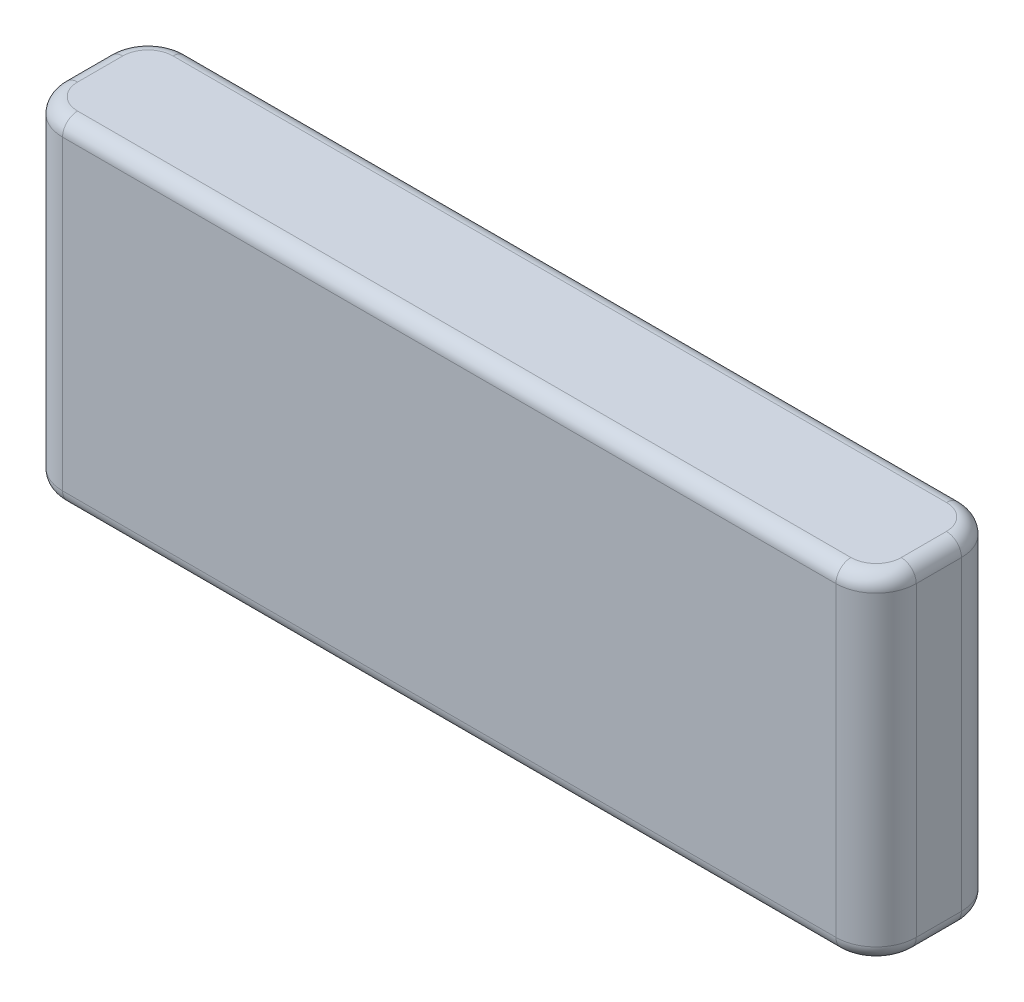
ISO-10303-21;
HEADER;
FILE_DESCRIPTION(('STEP AP214'),'2;1');
FILE_NAME('part.step','',(''),(''),'','','');
FILE_SCHEMA(('AUTOMOTIVE_DESIGN { 1 0 10303 214 1 1 1 1 }'));
ENDSEC;
DATA;
#1=APPLICATION_CONTEXT('core data for automotive mechanical design processes');
#2=APPLICATION_PROTOCOL_DEFINITION('international standard','automotive_design',2000,#1);
#3=PRODUCT_CONTEXT('',#1,'mechanical');
#4=PRODUCT('Part','Part','',(#3));
#5=PRODUCT_RELATED_PRODUCT_CATEGORY('part','',(#4));
#6=PRODUCT_DEFINITION_FORMATION('','',#4);
#7=PRODUCT_DEFINITION_CONTEXT('part definition',#1,'design');
#8=PRODUCT_DEFINITION('design','',#6,#7);
#9=PRODUCT_DEFINITION_SHAPE('','',#8);
#10=(LENGTH_UNIT() NAMED_UNIT(*) SI_UNIT(.MILLI.,.METRE.));
#11=(NAMED_UNIT(*) PLANE_ANGLE_UNIT() SI_UNIT($,.RADIAN.));
#12=(NAMED_UNIT(*) SI_UNIT($,.STERADIAN.) SOLID_ANGLE_UNIT());
#13=UNCERTAINTY_MEASURE_WITH_UNIT(LENGTH_MEASURE(1.E-05),#10,'distance_accuracy_value','');
#14=(GEOMETRIC_REPRESENTATION_CONTEXT(3) GLOBAL_UNCERTAINTY_ASSIGNED_CONTEXT((#13)) GLOBAL_UNIT_ASSIGNED_CONTEXT((#10,
#11,#12)) REPRESENTATION_CONTEXT('',''));
#15=CARTESIAN_POINT('',(0.,0.,0.));
#16=DIRECTION('',(0.,0.,1.));
#17=DIRECTION('',(1.,0.,0.));
#18=AXIS2_PLACEMENT_3D('',#15,#16,#17);
#19=CARTESIAN_POINT('',(-85.,33.5,12.5));
#20=DIRECTION('',(1.,0.,0.));
#21=DIRECTION('',(0.,0.,-1.));
#22=AXIS2_PLACEMENT_3D('',#19,#20,#21);
#23=PLANE('',#22);
#24=DIRECTION('',(0.,-1.,0.));
#25=VECTOR('',#24,1.);
#26=CARTESIAN_POINT('',(-85.,33.5,-4.50000000000001));
#27=LINE('',#26,#25);
#28=CARTESIAN_POINT('',(-85.,30.5,-4.50000000000001));
#29=VERTEX_POINT('',#28);
#30=CARTESIAN_POINT('',(-85.,-30.5,-4.50000000000001));
#31=VERTEX_POINT('',#30);
#32=EDGE_CURVE('E284',#29,#31,#27,.T.);
#33=ORIENTED_EDGE('',*,*,#32,.T.);
#34=DIRECTION('',(0.,0.,1.));
#35=VECTOR('',#34,1.);
#36=CARTESIAN_POINT('',(-85.,-30.5,4.5));
#37=LINE('',#36,#35);
#38=CARTESIAN_POINT('',(-85.,-30.5,4.5));
#39=VERTEX_POINT('',#38);
#40=EDGE_CURVE('E200',#31,#39,#37,.T.);
#41=ORIENTED_EDGE('',*,*,#40,.T.);
#42=DIRECTION('',(0.,-1.,0.));
#43=VECTOR('',#42,1.);
#44=CARTESIAN_POINT('',(-85.,33.5,4.5));
#45=LINE('',#44,#43);
#46=CARTESIAN_POINT('',(-85.,30.5,4.5));
#47=VERTEX_POINT('',#46);
#48=EDGE_CURVE('E289',#39,#47,#45,.F.);
#49=ORIENTED_EDGE('',*,*,#48,.T.);
#50=DIRECTION('',(0.,0.,1.));
#51=VECTOR('',#50,1.);
#52=CARTESIAN_POINT('',(-85.,30.5,12.5));
#53=LINE('',#52,#51);
#54=EDGE_CURVE('E198',#47,#29,#53,.F.);
#55=ORIENTED_EDGE('',*,*,#54,.T.);
#56=EDGE_LOOP('',(#33,#41,#49,#55));
#57=FACE_BOUND('',#56,.T.);
#58=ADVANCED_FACE('F34',(#57),#23,.F.);
#59=CARTESIAN_POINT('',(-85.,33.5,12.5));
#60=DIRECTION('',(0.,0.,-1.));
#61=DIRECTION('',(-1.,0.,0.));
#62=AXIS2_PLACEMENT_3D('',#59,#60,#61);
#63=PLANE('',#62);
#64=DIRECTION('',(0.,-1.,0.));
#65=VECTOR('',#64,1.);
#66=CARTESIAN_POINT('',(-77.,33.5,12.5));
#67=LINE('',#66,#65);
#68=CARTESIAN_POINT('',(-77.,30.5,12.5));
#69=VERTEX_POINT('',#68);
#70=CARTESIAN_POINT('',(-77.,-30.5,12.5));
#71=VERTEX_POINT('',#70);
#72=EDGE_CURVE('E282',#69,#71,#67,.T.);
#73=ORIENTED_EDGE('',*,*,#72,.T.);
#74=DIRECTION('',(1.,0.,0.));
#75=VECTOR('',#74,1.);
#76=CARTESIAN_POINT('',(77.,-30.5,12.5));
#77=LINE('',#76,#75);
#78=CARTESIAN_POINT('',(77.,-30.5,12.5));
#79=VERTEX_POINT('',#78);
#80=EDGE_CURVE('E208',#71,#79,#77,.T.);
#81=ORIENTED_EDGE('',*,*,#80,.T.);
#82=DIRECTION('',(0.,-1.,0.));
#83=VECTOR('',#82,1.);
#84=CARTESIAN_POINT('',(77.,33.5,12.5));
#85=LINE('',#84,#83);
#86=CARTESIAN_POINT('',(77.,30.5,12.5));
#87=VERTEX_POINT('',#86);
#88=EDGE_CURVE('E239',#79,#87,#85,.F.);
#89=ORIENTED_EDGE('',*,*,#88,.T.);
#90=DIRECTION('',(1.,0.,0.));
#91=VECTOR('',#90,1.);
#92=CARTESIAN_POINT('',(-85.,30.5,12.5));
#93=LINE('',#92,#91);
#94=EDGE_CURVE('E206',#87,#69,#93,.F.);
#95=ORIENTED_EDGE('',*,*,#94,.T.);
#96=EDGE_LOOP('',(#73,#81,#89,#95));
#97=FACE_BOUND('',#96,.T.);
#98=ADVANCED_FACE('F280',(#97),#63,.F.);
#99=CARTESIAN_POINT('',(85.,33.5,12.5));
#100=DIRECTION('',(-1.,0.,0.));
#101=DIRECTION('',(0.,0.,1.));
#102=AXIS2_PLACEMENT_3D('',#99,#100,#101);
#103=PLANE('',#102);
#104=DIRECTION('',(0.,-1.,0.));
#105=VECTOR('',#104,1.);
#106=CARTESIAN_POINT('',(85.,33.5,4.5));
#107=LINE('',#106,#105);
#108=CARTESIAN_POINT('',(85.,30.5,4.5));
#109=VERTEX_POINT('',#108);
#110=CARTESIAN_POINT('',(85.,-30.5,4.5));
#111=VERTEX_POINT('',#110);
#112=EDGE_CURVE('E277',#109,#111,#107,.T.);
#113=ORIENTED_EDGE('',*,*,#112,.T.);
#114=DIRECTION('',(0.,0.,-1.));
#115=VECTOR('',#114,1.);
#116=CARTESIAN_POINT('',(85.,-30.5,-4.50000000000001));
#117=LINE('',#116,#115);
#118=CARTESIAN_POINT('',(85.,-30.5,-4.50000000000001));
#119=VERTEX_POINT('',#118);
#120=EDGE_CURVE('E183',#111,#119,#117,.T.);
#121=ORIENTED_EDGE('',*,*,#120,.T.);
#122=DIRECTION('',(0.,-1.,0.));
#123=VECTOR('',#122,1.);
#124=CARTESIAN_POINT('',(85.,33.5,-4.50000000000001));
#125=LINE('',#124,#123);
#126=CARTESIAN_POINT('',(85.,30.5,-4.50000000000001));
#127=VERTEX_POINT('',#126);
#128=EDGE_CURVE('E167',#119,#127,#125,.F.);
#129=ORIENTED_EDGE('',*,*,#128,.T.);
#130=DIRECTION('',(0.,0.,-1.));
#131=VECTOR('',#130,1.);
#132=CARTESIAN_POINT('',(85.,30.5,12.5));
#133=LINE('',#132,#131);
#134=EDGE_CURVE('E181',#127,#109,#133,.F.);
#135=ORIENTED_EDGE('',*,*,#134,.T.);
#136=EDGE_LOOP('',(#113,#121,#129,#135));
#137=FACE_BOUND('',#136,.T.);
#138=ADVANCED_FACE('F319',(#137),#103,.F.);
#139=CARTESIAN_POINT('',(-85.,33.5,-12.5));
#140=DIRECTION('',(0.,0.,1.));
#141=DIRECTION('',(1.,0.,0.));
#142=AXIS2_PLACEMENT_3D('',#139,#140,#141);
#143=PLANE('',#142);
#144=DIRECTION('',(0.,-1.,0.));
#145=VECTOR('',#144,1.);
#146=CARTESIAN_POINT('',(77.,33.5,-12.5));
#147=LINE('',#146,#145);
#148=CARTESIAN_POINT('',(77.,30.5,-12.5));
#149=VERTEX_POINT('',#148);
#150=CARTESIAN_POINT('',(77.,-30.5,-12.5));
#151=VERTEX_POINT('',#150);
#152=EDGE_CURVE('E292',#149,#151,#147,.T.);
#153=ORIENTED_EDGE('',*,*,#152,.T.);
#154=DIRECTION('',(-1.,0.,0.));
#155=VECTOR('',#154,1.);
#156=CARTESIAN_POINT('',(-77.,-30.5,-12.5));
#157=LINE('',#156,#155);
#158=CARTESIAN_POINT('',(-77.,-30.5,-12.5));
#159=VERTEX_POINT('',#158);
#160=EDGE_CURVE('E191',#151,#159,#157,.T.);
#161=ORIENTED_EDGE('',*,*,#160,.T.);
#162=DIRECTION('',(0.,-1.,0.));
#163=VECTOR('',#162,1.);
#164=CARTESIAN_POINT('',(-77.,33.5,-12.5));
#165=LINE('',#164,#163);
#166=CARTESIAN_POINT('',(-77.,30.5,-12.5));
#167=VERTEX_POINT('',#166);
#168=EDGE_CURVE('E295',#159,#167,#165,.F.);
#169=ORIENTED_EDGE('',*,*,#168,.T.);
#170=DIRECTION('',(-1.,0.,0.));
#171=VECTOR('',#170,1.);
#172=CARTESIAN_POINT('',(-85.,30.5,-12.5));
#173=LINE('',#172,#171);
#174=EDGE_CURVE('E189',#167,#149,#173,.F.);
#175=ORIENTED_EDGE('',*,*,#174,.T.);
#176=EDGE_LOOP('',(#153,#161,#169,#175));
#177=FACE_BOUND('',#176,.T.);
#178=ADVANCED_FACE('F362',(#177),#143,.F.);
#179=CARTESIAN_POINT('',(0.,33.5,0.));
#180=DIRECTION('',(0.,-1.,0.));
#181=DIRECTION('',(0.,0.,-1.));
#182=AXIS2_PLACEMENT_3D('',#179,#180,#181);
#183=PLANE('',#182);
#184=DIRECTION('',(-1.,0.,0.));
#185=VECTOR('',#184,1.);
#186=CARTESIAN_POINT('',(0.,33.5,-9.50000000000001));
#187=LINE('',#186,#185);
#188=CARTESIAN_POINT('',(77.,33.5,-9.50000000000001));
#189=VERTEX_POINT('',#188);
#190=CARTESIAN_POINT('',(-77.,33.5,-9.50000000000001));
#191=VERTEX_POINT('',#190);
#192=EDGE_CURVE('E43',#189,#191,#187,.T.);
#193=ORIENTED_EDGE('',*,*,#192,.T.);
#194=CARTESIAN_POINT('',(-77.,33.5,-4.50000000000001));
#195=DIRECTION('',(0.,-1.,0.));
#196=DIRECTION('',(0.,0.,-1.));
#197=AXIS2_PLACEMENT_3D('',#194,#195,#196);
#198=CIRCLE('',#197,5.);
#199=CARTESIAN_POINT('',(-82.,33.5,-4.50000000000001));
#200=VERTEX_POINT('',#199);
#201=EDGE_CURVE('E11',#191,#200,#198,.F.);
#202=ORIENTED_EDGE('',*,*,#201,.T.);
#203=DIRECTION('',(0.,0.,1.));
#204=VECTOR('',#203,1.);
#205=CARTESIAN_POINT('',(-82.,33.5,0.));
#206=LINE('',#205,#204);
#207=CARTESIAN_POINT('',(-82.,33.5,4.5));
#208=VERTEX_POINT('',#207);
#209=EDGE_CURVE('E210',#200,#208,#206,.T.);
#210=ORIENTED_EDGE('',*,*,#209,.T.);
#211=CARTESIAN_POINT('',(-77.,33.5,4.5));
#212=DIRECTION('',(0.,-1.,0.));
#213=DIRECTION('',(0.,0.,-1.));
#214=AXIS2_PLACEMENT_3D('',#211,#212,#213);
#215=CIRCLE('',#214,5.);
#216=CARTESIAN_POINT('',(-77.,33.5,9.49999999999999));
#217=VERTEX_POINT('',#216);
#218=EDGE_CURVE('E212',#208,#217,#215,.F.);
#219=ORIENTED_EDGE('',*,*,#218,.T.);
#220=DIRECTION('',(1.,0.,0.));
#221=VECTOR('',#220,1.);
#222=CARTESIAN_POINT('',(0.,33.5,9.49999999999999));
#223=LINE('',#222,#221);
#224=CARTESIAN_POINT('',(77.,33.5,9.49999999999999));
#225=VERTEX_POINT('',#224);
#226=EDGE_CURVE('E214',#217,#225,#223,.T.);
#227=ORIENTED_EDGE('',*,*,#226,.T.);
#228=CARTESIAN_POINT('',(77.,33.5,4.5));
#229=DIRECTION('',(0.,-1.,0.));
#230=DIRECTION('',(0.,0.,-1.));
#231=AXIS2_PLACEMENT_3D('',#228,#229,#230);
#232=CIRCLE('',#231,5.);
#233=CARTESIAN_POINT('',(82.,33.5,4.5));
#234=VERTEX_POINT('',#233);
#235=EDGE_CURVE('E216',#225,#234,#232,.F.);
#236=ORIENTED_EDGE('',*,*,#235,.T.);
#237=DIRECTION('',(0.,0.,-1.));
#238=VECTOR('',#237,1.);
#239=CARTESIAN_POINT('',(82.,33.5,0.));
#240=LINE('',#239,#238);
#241=CARTESIAN_POINT('',(82.,33.5,-4.50000000000001));
#242=VERTEX_POINT('',#241);
#243=EDGE_CURVE('E218',#234,#242,#240,.T.);
#244=ORIENTED_EDGE('',*,*,#243,.T.);
#245=CARTESIAN_POINT('',(77.,33.5,-4.50000000000001));
#246=DIRECTION('',(0.,-1.,0.));
#247=DIRECTION('',(0.,0.,-1.));
#248=AXIS2_PLACEMENT_3D('',#245,#246,#247);
#249=CIRCLE('',#248,5.);
#250=EDGE_CURVE('E54',#242,#189,#249,.F.);
#251=ORIENTED_EDGE('',*,*,#250,.T.);
#252=EDGE_LOOP('',(#193,#202,#210,#219,#227,#236,#244,#251));
#253=FACE_BOUND('',#252,.T.);
#254=ADVANCED_FACE('F335',(#253),#183,.F.);
#255=CARTESIAN_POINT('',(0.,-33.5,0.));
#256=DIRECTION('',(0.,-1.,0.));
#257=DIRECTION('',(0.,0.,-1.));
#258=AXIS2_PLACEMENT_3D('',#255,#256,#257);
#259=PLANE('',#258);
#260=DIRECTION('',(0.,0.,-1.));
#261=VECTOR('',#260,1.);
#262=CARTESIAN_POINT('',(82.,-33.5,4.5));
#263=LINE('',#262,#261);
#264=CARTESIAN_POINT('',(82.,-33.5,-4.50000000000001));
#265=VERTEX_POINT('',#264);
#266=CARTESIAN_POINT('',(82.,-33.5,4.5));
#267=VERTEX_POINT('',#266);
#268=EDGE_CURVE('E171',#265,#267,#263,.F.);
#269=ORIENTED_EDGE('',*,*,#268,.T.);
#270=CARTESIAN_POINT('',(77.,-33.5,4.5));
#271=DIRECTION('',(0.,-1.,0.));
#272=DIRECTION('',(0.,0.,-1.));
#273=AXIS2_PLACEMENT_3D('',#270,#271,#272);
#274=CIRCLE('',#273,5.);
#275=CARTESIAN_POINT('',(77.,-33.5,9.49999999999999));
#276=VERTEX_POINT('',#275);
#277=EDGE_CURVE('E152',#267,#276,#274,.T.);
#278=ORIENTED_EDGE('',*,*,#277,.T.);
#279=DIRECTION('',(1.,0.,0.));
#280=VECTOR('',#279,1.);
#281=CARTESIAN_POINT('',(-77.,-33.5,9.49999999999999));
#282=LINE('',#281,#280);
#283=CARTESIAN_POINT('',(-77.,-33.5,9.49999999999999));
#284=VERTEX_POINT('',#283);
#285=EDGE_CURVE('E160',#276,#284,#282,.F.);
#286=ORIENTED_EDGE('',*,*,#285,.T.);
#287=CARTESIAN_POINT('',(-77.,-33.5,4.5));
#288=DIRECTION('',(0.,-1.,0.));
#289=DIRECTION('',(0.,0.,-1.));
#290=AXIS2_PLACEMENT_3D('',#287,#288,#289);
#291=CIRCLE('',#290,5.);
#292=CARTESIAN_POINT('',(-82.,-33.5,4.5));
#293=VERTEX_POINT('',#292);
#294=EDGE_CURVE('E166',#284,#293,#291,.T.);
#295=ORIENTED_EDGE('',*,*,#294,.T.);
#296=DIRECTION('',(0.,0.,1.));
#297=VECTOR('',#296,1.);
#298=CARTESIAN_POINT('',(-82.,-33.5,-4.50000000000001));
#299=LINE('',#298,#297);
#300=CARTESIAN_POINT('',(-82.,-33.5,-4.50000000000001));
#301=VERTEX_POINT('',#300);
#302=EDGE_CURVE('E302',#293,#301,#299,.F.);
#303=ORIENTED_EDGE('',*,*,#302,.T.);
#304=CARTESIAN_POINT('',(-77.,-33.5,-4.50000000000001));
#305=DIRECTION('',(0.,-1.,0.));
#306=DIRECTION('',(0.,0.,-1.));
#307=AXIS2_PLACEMENT_3D('',#304,#305,#306);
#308=CIRCLE('',#307,5.);
#309=CARTESIAN_POINT('',(-77.,-33.5,-9.50000000000001));
#310=VERTEX_POINT('',#309);
#311=EDGE_CURVE('E304',#301,#310,#308,.T.);
#312=ORIENTED_EDGE('',*,*,#311,.T.);
#313=DIRECTION('',(-1.,0.,0.));
#314=VECTOR('',#313,1.);
#315=CARTESIAN_POINT('',(77.,-33.5,-9.50000000000001));
#316=LINE('',#315,#314);
#317=CARTESIAN_POINT('',(77.,-33.5,-9.50000000000001));
#318=VERTEX_POINT('',#317);
#319=EDGE_CURVE('E306',#310,#318,#316,.F.);
#320=ORIENTED_EDGE('',*,*,#319,.T.);
#321=CARTESIAN_POINT('',(77.,-33.5,-4.50000000000001));
#322=DIRECTION('',(0.,-1.,0.));
#323=DIRECTION('',(0.,0.,-1.));
#324=AXIS2_PLACEMENT_3D('',#321,#322,#323);
#325=CIRCLE('',#324,5.);
#326=EDGE_CURVE('E176',#318,#265,#325,.T.);
#327=ORIENTED_EDGE('',*,*,#326,.T.);
#328=EDGE_LOOP('',(#269,#278,#286,#295,#303,#312,#320,#327));
#329=FACE_BOUND('',#328,.T.);
#330=ADVANCED_FACE('F169',(#329),#259,.T.);
#331=CARTESIAN_POINT('',(-77.,33.5,4.5));
#332=DIRECTION('',(0.,-1.,0.));
#333=DIRECTION('',(0.,0.,-1.));
#334=AXIS2_PLACEMENT_3D('',#331,#332,#333);
#335=CYLINDRICAL_SURFACE('',#334,8.);
#336=ORIENTED_EDGE('',*,*,#48,.F.);
#337=CARTESIAN_POINT('',(-77.,-30.5,4.5));
#338=DIRECTION('',(0.,-1.,0.));
#339=DIRECTION('',(0.,0.,-1.));
#340=AXIS2_PLACEMENT_3D('',#337,#338,#339);
#341=CIRCLE('',#340,8.);
#342=EDGE_CURVE('E204',#39,#71,#341,.F.);
#343=ORIENTED_EDGE('',*,*,#342,.T.);
#344=ORIENTED_EDGE('',*,*,#72,.F.);
#345=CARTESIAN_POINT('',(-77.,30.5,4.5));
#346=DIRECTION('',(0.,-1.,0.));
#347=DIRECTION('',(0.,0.,-1.));
#348=AXIS2_PLACEMENT_3D('',#345,#346,#347);
#349=CIRCLE('',#348,8.);
#350=EDGE_CURVE('E202',#69,#47,#349,.T.);
#351=ORIENTED_EDGE('',*,*,#350,.T.);
#352=EDGE_LOOP('',(#336,#343,#344,#351));
#353=FACE_BOUND('',#352,.T.);
#354=ADVANCED_FACE('F379',(#353),#335,.T.);
#355=CARTESIAN_POINT('',(-77.,33.5,-4.50000000000001));
#356=DIRECTION('',(0.,-1.,0.));
#357=DIRECTION('',(0.,0.,-1.));
#358=AXIS2_PLACEMENT_3D('',#355,#356,#357);
#359=CYLINDRICAL_SURFACE('',#358,8.);
#360=ORIENTED_EDGE('',*,*,#168,.F.);
#361=CARTESIAN_POINT('',(-77.,-30.5,-4.50000000000001));
#362=DIRECTION('',(0.,-1.,0.));
#363=DIRECTION('',(0.,0.,-1.));
#364=AXIS2_PLACEMENT_3D('',#361,#362,#363);
#365=CIRCLE('',#364,8.);
#366=EDGE_CURVE('E196',#159,#31,#365,.F.);
#367=ORIENTED_EDGE('',*,*,#366,.T.);
#368=ORIENTED_EDGE('',*,*,#32,.F.);
#369=CARTESIAN_POINT('',(-77.,30.5,-4.50000000000001));
#370=DIRECTION('',(0.,-1.,0.));
#371=DIRECTION('',(0.,0.,-1.));
#372=AXIS2_PLACEMENT_3D('',#369,#370,#371);
#373=CIRCLE('',#372,8.);
#374=EDGE_CURVE('E193',#29,#167,#373,.T.);
#375=ORIENTED_EDGE('',*,*,#374,.T.);
#376=EDGE_LOOP('',(#360,#367,#368,#375));
#377=FACE_BOUND('',#376,.T.);
#378=ADVANCED_FACE('F351',(#377),#359,.T.);
#379=CARTESIAN_POINT('',(77.,33.5,-4.50000000000001));
#380=DIRECTION('',(0.,-1.,0.));
#381=DIRECTION('',(0.,0.,-1.));
#382=AXIS2_PLACEMENT_3D('',#379,#380,#381);
#383=CYLINDRICAL_SURFACE('',#382,8.);
#384=ORIENTED_EDGE('',*,*,#128,.F.);
#385=CARTESIAN_POINT('',(77.,-30.5,-4.50000000000001));
#386=DIRECTION('',(0.,-1.,0.));
#387=DIRECTION('',(0.,0.,-1.));
#388=AXIS2_PLACEMENT_3D('',#385,#386,#387);
#389=CIRCLE('',#388,8.);
#390=EDGE_CURVE('E187',#119,#151,#389,.F.);
#391=ORIENTED_EDGE('',*,*,#390,.T.);
#392=ORIENTED_EDGE('',*,*,#152,.F.);
#393=CARTESIAN_POINT('',(77.,30.5,-4.50000000000001));
#394=DIRECTION('',(0.,-1.,0.));
#395=DIRECTION('',(0.,0.,-1.));
#396=AXIS2_PLACEMENT_3D('',#393,#394,#395);
#397=CIRCLE('',#396,8.);
#398=EDGE_CURVE('E185',#149,#127,#397,.T.);
#399=ORIENTED_EDGE('',*,*,#398,.T.);
#400=EDGE_LOOP('',(#384,#391,#392,#399));
#401=FACE_BOUND('',#400,.T.);
#402=ADVANCED_FACE('F321',(#401),#383,.T.);
#403=CARTESIAN_POINT('',(77.,33.5,4.5));
#404=DIRECTION('',(0.,-1.,0.));
#405=DIRECTION('',(0.,0.,-1.));
#406=AXIS2_PLACEMENT_3D('',#403,#404,#405);
#407=CYLINDRICAL_SURFACE('',#406,8.);
#408=ORIENTED_EDGE('',*,*,#88,.F.);
#409=CARTESIAN_POINT('',(77.,-30.5,4.5));
#410=DIRECTION('',(0.,-1.,0.));
#411=DIRECTION('',(0.,0.,-1.));
#412=AXIS2_PLACEMENT_3D('',#409,#410,#411);
#413=CIRCLE('',#412,8.);
#414=EDGE_CURVE('E154',#79,#111,#413,.F.);
#415=ORIENTED_EDGE('',*,*,#414,.T.);
#416=ORIENTED_EDGE('',*,*,#112,.F.);
#417=CARTESIAN_POINT('',(77.,30.5,4.5));
#418=DIRECTION('',(0.,-1.,0.));
#419=DIRECTION('',(0.,0.,-1.));
#420=AXIS2_PLACEMENT_3D('',#417,#418,#419);
#421=CIRCLE('',#420,8.);
#422=EDGE_CURVE('E173',#109,#87,#421,.T.);
#423=ORIENTED_EDGE('',*,*,#422,.T.);
#424=EDGE_LOOP('',(#408,#415,#416,#423));
#425=FACE_BOUND('',#424,.T.);
#426=ADVANCED_FACE('F275',(#425),#407,.T.);
#427=CARTESIAN_POINT('',(-77.,-30.5,-4.50000000000001));
#428=DIRECTION('',(0.,-1.,0.));
#429=DIRECTION('',(0.,0.,-1.));
#430=AXIS2_PLACEMENT_3D('',#427,#428,#429);
#431=TOROIDAL_SURFACE('',#430,5.,3.);
#432=CARTESIAN_POINT('',(-82.,-30.5,-4.50000000000001));
#433=DIRECTION('',(0.,0.,1.));
#434=DIRECTION('',(1.,0.,0.));
#435=AXIS2_PLACEMENT_3D('',#432,#433,#434);
#436=CIRCLE('',#435,3.);
#437=EDGE_CURVE('E233',#31,#301,#436,.T.);
#438=ORIENTED_EDGE('',*,*,#437,.F.);
#439=ORIENTED_EDGE('',*,*,#366,.F.);
#440=CARTESIAN_POINT('',(-77.,-30.5,-9.50000000000001));
#441=DIRECTION('',(1.,0.,0.));
#442=DIRECTION('',(0.,0.,-1.));
#443=AXIS2_PLACEMENT_3D('',#440,#441,#442);
#444=CIRCLE('',#443,3.);
#445=EDGE_CURVE('E236',#310,#159,#444,.T.);
#446=ORIENTED_EDGE('',*,*,#445,.F.);
#447=ORIENTED_EDGE('',*,*,#311,.F.);
#448=EDGE_LOOP('',(#438,#439,#446,#447));
#449=FACE_BOUND('',#448,.T.);
#450=ADVANCED_FACE('F355',(#449),#431,.T.);
#451=CARTESIAN_POINT('',(-85.,-30.5,-9.50000000000001));
#452=DIRECTION('',(1.,0.,0.));
#453=DIRECTION('',(0.,0.,-1.));
#454=AXIS2_PLACEMENT_3D('',#451,#452,#453);
#455=CYLINDRICAL_SURFACE('',#454,3.);
#456=ORIENTED_EDGE('',*,*,#445,.T.);
#457=ORIENTED_EDGE('',*,*,#160,.F.);
#458=CARTESIAN_POINT('',(77.,-30.5,-9.50000000000001));
#459=DIRECTION('',(1.,0.,0.));
#460=DIRECTION('',(0.,0.,-1.));
#461=AXIS2_PLACEMENT_3D('',#458,#459,#460);
#462=CIRCLE('',#461,3.);
#463=EDGE_CURVE('E230',#318,#151,#462,.T.);
#464=ORIENTED_EDGE('',*,*,#463,.F.);
#465=ORIENTED_EDGE('',*,*,#319,.F.);
#466=EDGE_LOOP('',(#456,#457,#464,#465));
#467=FACE_BOUND('',#466,.T.);
#468=ADVANCED_FACE('F360',(#467),#455,.T.);
#469=CARTESIAN_POINT('',(-82.,-30.5,12.5));
#470=DIRECTION('',(0.,0.,-1.));
#471=DIRECTION('',(-1.,0.,0.));
#472=AXIS2_PLACEMENT_3D('',#469,#470,#471);
#473=CYLINDRICAL_SURFACE('',#472,3.);
#474=ORIENTED_EDGE('',*,*,#437,.T.);
#475=ORIENTED_EDGE('',*,*,#302,.F.);
#476=CARTESIAN_POINT('',(-82.,-30.5,4.5));
#477=DIRECTION('',(0.,0.,1.));
#478=DIRECTION('',(1.,0.,0.));
#479=AXIS2_PLACEMENT_3D('',#476,#477,#478);
#480=CIRCLE('',#479,3.);
#481=EDGE_CURVE('E227',#39,#293,#480,.T.);
#482=ORIENTED_EDGE('',*,*,#481,.F.);
#483=ORIENTED_EDGE('',*,*,#40,.F.);
#484=EDGE_LOOP('',(#474,#475,#482,#483));
#485=FACE_BOUND('',#484,.T.);
#486=ADVANCED_FACE('F401',(#485),#473,.T.);
#487=CARTESIAN_POINT('',(77.,-30.5,-4.50000000000001));
#488=DIRECTION('',(0.,-1.,0.));
#489=DIRECTION('',(0.,0.,-1.));
#490=AXIS2_PLACEMENT_3D('',#487,#488,#489);
#491=TOROIDAL_SURFACE('',#490,5.,3.);
#492=ORIENTED_EDGE('',*,*,#463,.T.);
#493=ORIENTED_EDGE('',*,*,#390,.F.);
#494=CARTESIAN_POINT('',(82.,-30.5,-4.50000000000001));
#495=DIRECTION('',(0.,0.,1.));
#496=DIRECTION('',(1.,0.,0.));
#497=AXIS2_PLACEMENT_3D('',#494,#495,#496);
#498=CIRCLE('',#497,3.);
#499=EDGE_CURVE('E224',#265,#119,#498,.T.);
#500=ORIENTED_EDGE('',*,*,#499,.F.);
#501=ORIENTED_EDGE('',*,*,#326,.F.);
#502=EDGE_LOOP('',(#492,#493,#500,#501));
#503=FACE_BOUND('',#502,.T.);
#504=ADVANCED_FACE('F313',(#503),#491,.T.);
#505=CARTESIAN_POINT('',(-77.,-30.5,4.5));
#506=DIRECTION('',(0.,-1.,0.));
#507=DIRECTION('',(0.,0.,-1.));
#508=AXIS2_PLACEMENT_3D('',#505,#506,#507);
#509=TOROIDAL_SURFACE('',#508,5.,3.);
#510=ORIENTED_EDGE('',*,*,#481,.T.);
#511=ORIENTED_EDGE('',*,*,#294,.F.);
#512=CARTESIAN_POINT('',(-77.,-30.5,9.49999999999999));
#513=DIRECTION('',(1.,0.,0.));
#514=DIRECTION('',(0.,0.,-1.));
#515=AXIS2_PLACEMENT_3D('',#512,#513,#514);
#516=CIRCLE('',#515,3.);
#517=EDGE_CURVE('E163',#71,#284,#516,.T.);
#518=ORIENTED_EDGE('',*,*,#517,.F.);
#519=ORIENTED_EDGE('',*,*,#342,.F.);
#520=EDGE_LOOP('',(#510,#511,#518,#519));
#521=FACE_BOUND('',#520,.T.);
#522=ADVANCED_FACE('F395',(#521),#509,.T.);
#523=CARTESIAN_POINT('',(82.,-30.5,12.5));
#524=DIRECTION('',(0.,0.,1.));
#525=DIRECTION('',(1.,0.,0.));
#526=AXIS2_PLACEMENT_3D('',#523,#524,#525);
#527=CYLINDRICAL_SURFACE('',#526,3.);
#528=ORIENTED_EDGE('',*,*,#499,.T.);
#529=ORIENTED_EDGE('',*,*,#120,.F.);
#530=CARTESIAN_POINT('',(82.,-30.5,4.5));
#531=DIRECTION('',(0.,0.,1.));
#532=DIRECTION('',(1.,0.,0.));
#533=AXIS2_PLACEMENT_3D('',#530,#531,#532);
#534=CIRCLE('',#533,3.);
#535=EDGE_CURVE('E157',#267,#111,#534,.T.);
#536=ORIENTED_EDGE('',*,*,#535,.F.);
#537=ORIENTED_EDGE('',*,*,#268,.F.);
#538=EDGE_LOOP('',(#528,#529,#536,#537));
#539=FACE_BOUND('',#538,.T.);
#540=ADVANCED_FACE('F316',(#539),#527,.T.);
#541=CARTESIAN_POINT('',(-85.,-30.5,9.49999999999999));
#542=DIRECTION('',(-1.,0.,0.));
#543=DIRECTION('',(0.,0.,1.));
#544=AXIS2_PLACEMENT_3D('',#541,#542,#543);
#545=CYLINDRICAL_SURFACE('',#544,3.);
#546=ORIENTED_EDGE('',*,*,#517,.T.);
#547=ORIENTED_EDGE('',*,*,#285,.F.);
#548=CARTESIAN_POINT('',(77.,-30.5,9.49999999999999));
#549=DIRECTION('',(1.,0.,0.));
#550=DIRECTION('',(0.,0.,-1.));
#551=AXIS2_PLACEMENT_3D('',#548,#549,#550);
#552=CIRCLE('',#551,3.);
#553=EDGE_CURVE('E148',#79,#276,#552,.T.);
#554=ORIENTED_EDGE('',*,*,#553,.F.);
#555=ORIENTED_EDGE('',*,*,#80,.F.);
#556=EDGE_LOOP('',(#546,#547,#554,#555));
#557=FACE_BOUND('',#556,.T.);
#558=ADVANCED_FACE('F161',(#557),#545,.T.);
#559=CARTESIAN_POINT('',(77.,-30.5,4.5));
#560=DIRECTION('',(0.,-1.,0.));
#561=DIRECTION('',(0.,0.,-1.));
#562=AXIS2_PLACEMENT_3D('',#559,#560,#561);
#563=TOROIDAL_SURFACE('',#562,5.,3.);
#564=ORIENTED_EDGE('',*,*,#535,.T.);
#565=ORIENTED_EDGE('',*,*,#414,.F.);
#566=ORIENTED_EDGE('',*,*,#553,.T.);
#567=ORIENTED_EDGE('',*,*,#277,.F.);
#568=EDGE_LOOP('',(#564,#565,#566,#567));
#569=FACE_BOUND('',#568,.T.);
#570=ADVANCED_FACE('F150',(#569),#563,.T.);
#571=CARTESIAN_POINT('',(77.,30.5,4.5));
#572=DIRECTION('',(0.,-1.,0.));
#573=DIRECTION('',(0.,0.,-1.));
#574=AXIS2_PLACEMENT_3D('',#571,#572,#573);
#575=TOROIDAL_SURFACE('',#574,5.,3.);
#576=CARTESIAN_POINT('',(77.,30.5,9.49999999999999));
#577=DIRECTION('',(-1.,0.,0.));
#578=DIRECTION('',(0.,0.,1.));
#579=AXIS2_PLACEMENT_3D('',#576,#577,#578);
#580=CIRCLE('',#579,3.);
#581=EDGE_CURVE('E255',#87,#225,#580,.T.);
#582=ORIENTED_EDGE('',*,*,#581,.F.);
#583=ORIENTED_EDGE('',*,*,#422,.F.);
#584=CARTESIAN_POINT('',(82.,30.5,4.5));
#585=DIRECTION('',(0.,0.,-1.));
#586=DIRECTION('',(-1.,0.,0.));
#587=AXIS2_PLACEMENT_3D('',#584,#585,#586);
#588=CIRCLE('',#587,3.);
#589=EDGE_CURVE('E38',#234,#109,#588,.T.);
#590=ORIENTED_EDGE('',*,*,#589,.F.);
#591=ORIENTED_EDGE('',*,*,#235,.F.);
#592=EDGE_LOOP('',(#582,#583,#590,#591));
#593=FACE_BOUND('',#592,.T.);
#594=ADVANCED_FACE('F36',(#593),#575,.T.);
#595=CARTESIAN_POINT('',(82.,30.5,0.));
#596=DIRECTION('',(0.,0.,-1.));
#597=DIRECTION('',(-1.,0.,0.));
#598=AXIS2_PLACEMENT_3D('',#595,#596,#597);
#599=CYLINDRICAL_SURFACE('',#598,3.);
#600=ORIENTED_EDGE('',*,*,#589,.T.);
#601=ORIENTED_EDGE('',*,*,#134,.F.);
#602=CARTESIAN_POINT('',(82.,30.5,-4.50000000000001));
#603=DIRECTION('',(0.,0.,-1.));
#604=DIRECTION('',(-1.,0.,0.));
#605=AXIS2_PLACEMENT_3D('',#602,#603,#604);
#606=CIRCLE('',#605,3.);
#607=EDGE_CURVE('E253',#242,#127,#606,.T.);
#608=ORIENTED_EDGE('',*,*,#607,.F.);
#609=ORIENTED_EDGE('',*,*,#243,.F.);
#610=EDGE_LOOP('',(#600,#601,#608,#609));
#611=FACE_BOUND('',#610,.T.);
#612=ADVANCED_FACE('F266',(#611),#599,.T.);
#613=CARTESIAN_POINT('',(0.,30.5,9.49999999999999));
#614=DIRECTION('',(1.,0.,0.));
#615=DIRECTION('',(0.,0.,-1.));
#616=AXIS2_PLACEMENT_3D('',#613,#614,#615);
#617=CYLINDRICAL_SURFACE('',#616,3.);
#618=ORIENTED_EDGE('',*,*,#581,.T.);
#619=ORIENTED_EDGE('',*,*,#226,.F.);
#620=CARTESIAN_POINT('',(-77.,30.5,9.49999999999999));
#621=DIRECTION('',(-1.,0.,0.));
#622=DIRECTION('',(0.,0.,1.));
#623=AXIS2_PLACEMENT_3D('',#620,#621,#622);
#624=CIRCLE('',#623,3.);
#625=EDGE_CURVE('E250',#69,#217,#624,.T.);
#626=ORIENTED_EDGE('',*,*,#625,.F.);
#627=ORIENTED_EDGE('',*,*,#94,.F.);
#628=EDGE_LOOP('',(#618,#619,#626,#627));
#629=FACE_BOUND('',#628,.T.);
#630=ADVANCED_FACE('F419',(#629),#617,.T.);
#631=CARTESIAN_POINT('',(77.,30.5,-4.50000000000001));
#632=DIRECTION('',(0.,-1.,0.));
#633=DIRECTION('',(0.,0.,-1.));
#634=AXIS2_PLACEMENT_3D('',#631,#632,#633);
#635=TOROIDAL_SURFACE('',#634,5.,3.);
#636=ORIENTED_EDGE('',*,*,#607,.T.);
#637=ORIENTED_EDGE('',*,*,#398,.F.);
#638=CARTESIAN_POINT('',(77.,30.5,-9.50000000000001));
#639=DIRECTION('',(-1.,0.,0.));
#640=DIRECTION('',(0.,0.,1.));
#641=AXIS2_PLACEMENT_3D('',#638,#639,#640);
#642=CIRCLE('',#641,3.);
#643=EDGE_CURVE('E247',#189,#149,#642,.T.);
#644=ORIENTED_EDGE('',*,*,#643,.F.);
#645=ORIENTED_EDGE('',*,*,#250,.F.);
#646=EDGE_LOOP('',(#636,#637,#644,#645));
#647=FACE_BOUND('',#646,.T.);
#648=ADVANCED_FACE('F325',(#647),#635,.T.);
#649=CARTESIAN_POINT('',(-77.,30.5,4.5));
#650=DIRECTION('',(0.,-1.,0.));
#651=DIRECTION('',(0.,0.,-1.));
#652=AXIS2_PLACEMENT_3D('',#649,#650,#651);
#653=TOROIDAL_SURFACE('',#652,5.,3.);
#654=ORIENTED_EDGE('',*,*,#625,.T.);
#655=ORIENTED_EDGE('',*,*,#218,.F.);
#656=CARTESIAN_POINT('',(-82.,30.5,4.5));
#657=DIRECTION('',(0.,0.,-1.));
#658=DIRECTION('',(-1.,0.,0.));
#659=AXIS2_PLACEMENT_3D('',#656,#657,#658);
#660=CIRCLE('',#659,3.);
#661=EDGE_CURVE('E244',#47,#208,#660,.T.);
#662=ORIENTED_EDGE('',*,*,#661,.F.);
#663=ORIENTED_EDGE('',*,*,#350,.F.);
#664=EDGE_LOOP('',(#654,#655,#662,#663));
#665=FACE_BOUND('',#664,.T.);
#666=ADVANCED_FACE('F340',(#665),#653,.T.);
#667=CARTESIAN_POINT('',(0.,30.5,-9.50000000000001));
#668=DIRECTION('',(-1.,0.,0.));
#669=DIRECTION('',(0.,0.,1.));
#670=AXIS2_PLACEMENT_3D('',#667,#668,#669);
#671=CYLINDRICAL_SURFACE('',#670,3.);
#672=ORIENTED_EDGE('',*,*,#643,.T.);
#673=ORIENTED_EDGE('',*,*,#174,.F.);
#674=CARTESIAN_POINT('',(-77.,30.5,-9.50000000000001));
#675=DIRECTION('',(-1.,0.,0.));
#676=DIRECTION('',(0.,0.,1.));
#677=AXIS2_PLACEMENT_3D('',#674,#675,#676);
#678=CIRCLE('',#677,3.);
#679=EDGE_CURVE('E242',#191,#167,#678,.T.);
#680=ORIENTED_EDGE('',*,*,#679,.F.);
#681=ORIENTED_EDGE('',*,*,#192,.F.);
#682=EDGE_LOOP('',(#672,#673,#680,#681));
#683=FACE_BOUND('',#682,.T.);
#684=ADVANCED_FACE('F328',(#683),#671,.T.);
#685=CARTESIAN_POINT('',(-82.,30.5,0.));
#686=DIRECTION('',(0.,0.,1.));
#687=DIRECTION('',(1.,0.,0.));
#688=AXIS2_PLACEMENT_3D('',#685,#686,#687);
#689=CYLINDRICAL_SURFACE('',#688,3.);
#690=ORIENTED_EDGE('',*,*,#661,.T.);
#691=ORIENTED_EDGE('',*,*,#209,.F.);
#692=CARTESIAN_POINT('',(-82.,30.5,-4.50000000000001));
#693=DIRECTION('',(0.,0.,-1.));
#694=DIRECTION('',(-1.,0.,0.));
#695=AXIS2_PLACEMENT_3D('',#692,#693,#694);
#696=CIRCLE('',#695,3.);
#697=EDGE_CURVE('E240',#29,#200,#696,.T.);
#698=ORIENTED_EDGE('',*,*,#697,.F.);
#699=ORIENTED_EDGE('',*,*,#54,.F.);
#700=EDGE_LOOP('',(#690,#691,#698,#699));
#701=FACE_BOUND('',#700,.T.);
#702=ADVANCED_FACE('F344',(#701),#689,.T.);
#703=CARTESIAN_POINT('',(-77.,30.5,-4.50000000000001));
#704=DIRECTION('',(0.,-1.,0.));
#705=DIRECTION('',(0.,0.,-1.));
#706=AXIS2_PLACEMENT_3D('',#703,#704,#705);
#707=TOROIDAL_SURFACE('',#706,5.,3.);
#708=ORIENTED_EDGE('',*,*,#679,.T.);
#709=ORIENTED_EDGE('',*,*,#374,.F.);
#710=ORIENTED_EDGE('',*,*,#697,.T.);
#711=ORIENTED_EDGE('',*,*,#201,.F.);
#712=EDGE_LOOP('',(#708,#709,#710,#711));
#713=FACE_BOUND('',#712,.T.);
#714=ADVANCED_FACE('F332',(#713),#707,.T.);
#715=CLOSED_SHELL('',(#58,#98,#138,#178,#254,#330,#354,#378,#402,#426,#450,#468,#486,#504,#522,
#540,#558,#570,#594,#612,#630,#648,#666,#684,#702,#714));
#716=MANIFOLD_SOLID_BREP('B2',#715);
#717=ADVANCED_BREP_SHAPE_REPRESENTATION('',(#18,#716),#14);
#718=SHAPE_DEFINITION_REPRESENTATION(#9,#717);
ENDSEC;
END-ISO-10303-21;
